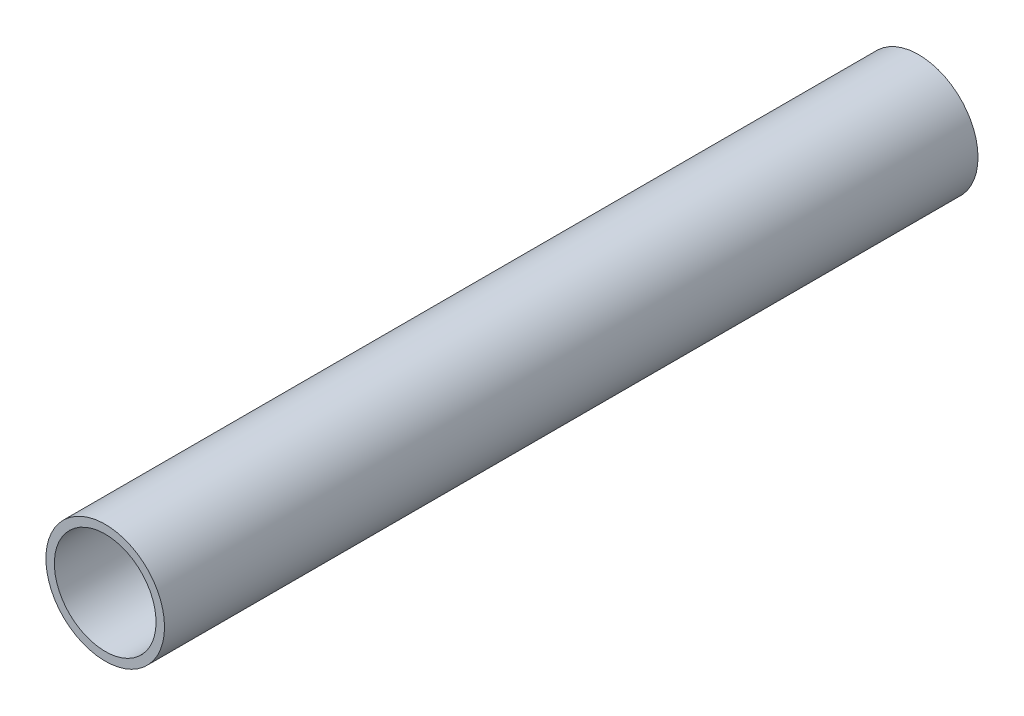
ISO-10303-21;
HEADER;
FILE_DESCRIPTION(('STEP AP214'),'2;1');
FILE_NAME('part.step','',(''),(''),'','','');
FILE_SCHEMA(('AUTOMOTIVE_DESIGN { 1 0 10303 214 1 1 1 1 }'));
ENDSEC;
DATA;
#1=APPLICATION_CONTEXT('core data for automotive mechanical design processes');
#2=APPLICATION_PROTOCOL_DEFINITION('international standard','automotive_design',2000,#1);
#3=PRODUCT_CONTEXT('',#1,'mechanical');
#4=PRODUCT('Part','Part','',(#3));
#5=PRODUCT_RELATED_PRODUCT_CATEGORY('part','',(#4));
#6=PRODUCT_DEFINITION_FORMATION('','',#4);
#7=PRODUCT_DEFINITION_CONTEXT('part definition',#1,'design');
#8=PRODUCT_DEFINITION('design','',#6,#7);
#9=PRODUCT_DEFINITION_SHAPE('','',#8);
#10=(LENGTH_UNIT() NAMED_UNIT(*) SI_UNIT(.MILLI.,.METRE.));
#11=(NAMED_UNIT(*) PLANE_ANGLE_UNIT() SI_UNIT($,.RADIAN.));
#12=(NAMED_UNIT(*) SI_UNIT($,.STERADIAN.) SOLID_ANGLE_UNIT());
#13=UNCERTAINTY_MEASURE_WITH_UNIT(LENGTH_MEASURE(1.E-05),#10,'distance_accuracy_value','');
#14=(GEOMETRIC_REPRESENTATION_CONTEXT(3) GLOBAL_UNCERTAINTY_ASSIGNED_CONTEXT((#13)) GLOBAL_UNIT_ASSIGNED_CONTEXT((#10,
#11,#12)) REPRESENTATION_CONTEXT('',''));
#15=CARTESIAN_POINT('',(0.,0.,0.));
#16=DIRECTION('',(0.,0.,1.));
#17=DIRECTION('',(1.,0.,0.));
#18=AXIS2_PLACEMENT_3D('',#15,#16,#17);
#19=CARTESIAN_POINT('',(0.,0.,-152.4));
#20=DIRECTION('',(0.,0.,1.));
#21=DIRECTION('',(1.,0.,0.));
#22=AXIS2_PLACEMENT_3D('',#19,#20,#21);
#23=CYLINDRICAL_SURFACE('',#22,11.1125);
#24=CARTESIAN_POINT('',(0.,0.,-152.4));
#25=DIRECTION('',(0.,0.,1.));
#26=DIRECTION('',(1.,0.,0.));
#27=AXIS2_PLACEMENT_3D('',#24,#25,#26);
#28=CIRCLE('',#27,11.1125);
#29=CARTESIAN_POINT('',(11.1125,0.,-152.4));
#30=VERTEX_POINT('',#29);
#31=EDGE_CURVE('E10',#30,#30,#28,.T.);
#32=ORIENTED_EDGE('',*,*,#31,.T.);
#33=EDGE_LOOP('',(#32));
#34=FACE_BOUND('',#33,.T.);
#35=CARTESIAN_POINT('',(0.,0.,0.));
#36=DIRECTION('',(0.,0.,1.));
#37=DIRECTION('',(1.,0.,0.));
#38=AXIS2_PLACEMENT_3D('',#35,#36,#37);
#39=CIRCLE('',#38,11.1125);
#40=CARTESIAN_POINT('',(11.1125,0.,0.));
#41=VERTEX_POINT('',#40);
#42=EDGE_CURVE('E35',#41,#41,#39,.T.);
#43=ORIENTED_EDGE('',*,*,#42,.F.);
#44=EDGE_LOOP('',(#43));
#45=FACE_BOUND('',#44,.T.);
#46=ADVANCED_FACE('F32',(#34,#45),#23,.T.);
#47=CARTESIAN_POINT('',(0.,0.,-152.4));
#48=DIRECTION('',(0.,0.,1.));
#49=DIRECTION('',(1.,0.,0.));
#50=AXIS2_PLACEMENT_3D('',#47,#48,#49);
#51=PLANE('',#50);
#52=CARTESIAN_POINT('',(0.,0.,-152.4));
#53=DIRECTION('',(0.,0.,1.));
#54=DIRECTION('',(1.,0.,0.));
#55=AXIS2_PLACEMENT_3D('',#52,#53,#54);
#56=CIRCLE('',#55,9.525);
#57=CARTESIAN_POINT('',(9.525,0.,-152.4));
#58=VERTEX_POINT('',#57);
#59=EDGE_CURVE('E42',#58,#58,#56,.T.);
#60=ORIENTED_EDGE('',*,*,#59,.T.);
#61=EDGE_LOOP('',(#60));
#62=FACE_BOUND('',#61,.T.);
#63=ORIENTED_EDGE('',*,*,#31,.F.);
#64=EDGE_LOOP('',(#63));
#65=FACE_BOUND('',#64,.T.);
#66=ADVANCED_FACE('F50',(#62,#65),#51,.F.);
#67=CARTESIAN_POINT('',(0.,0.,0.));
#68=DIRECTION('',(0.,0.,1.));
#69=DIRECTION('',(1.,0.,0.));
#70=AXIS2_PLACEMENT_3D('',#67,#68,#69);
#71=PLANE('',#70);
#72=CARTESIAN_POINT('',(0.,0.,0.));
#73=DIRECTION('',(0.,0.,1.));
#74=DIRECTION('',(1.,0.,0.));
#75=AXIS2_PLACEMENT_3D('',#72,#73,#74);
#76=CIRCLE('',#75,9.525);
#77=CARTESIAN_POINT('',(9.525,0.,0.));
#78=VERTEX_POINT('',#77);
#79=EDGE_CURVE('E44',#78,#78,#76,.T.);
#80=ORIENTED_EDGE('',*,*,#79,.F.);
#81=EDGE_LOOP('',(#80));
#82=FACE_BOUND('',#81,.T.);
#83=ORIENTED_EDGE('',*,*,#42,.T.);
#84=EDGE_LOOP('',(#83));
#85=FACE_BOUND('',#84,.T.);
#86=ADVANCED_FACE('F56',(#82,#85),#71,.T.);
#87=CARTESIAN_POINT('',(0.,0.,-152.4));
#88=DIRECTION('',(0.,0.,1.));
#89=DIRECTION('',(1.,0.,0.));
#90=AXIS2_PLACEMENT_3D('',#87,#88,#89);
#91=CYLINDRICAL_SURFACE('',#90,9.525);
#92=ORIENTED_EDGE('',*,*,#59,.F.);
#93=EDGE_LOOP('',(#92));
#94=FACE_BOUND('',#93,.T.);
#95=ORIENTED_EDGE('',*,*,#79,.T.);
#96=EDGE_LOOP('',(#95));
#97=FACE_BOUND('',#96,.T.);
#98=ADVANCED_FACE('F53',(#94,#97),#91,.F.);
#99=CLOSED_SHELL('',(#46,#66,#86,#98));
#100=MANIFOLD_SOLID_BREP('B2',#99);
#101=ADVANCED_BREP_SHAPE_REPRESENTATION('',(#18,#100),#14);
#102=SHAPE_DEFINITION_REPRESENTATION(#9,#101);
ENDSEC;
END-ISO-10303-21;
